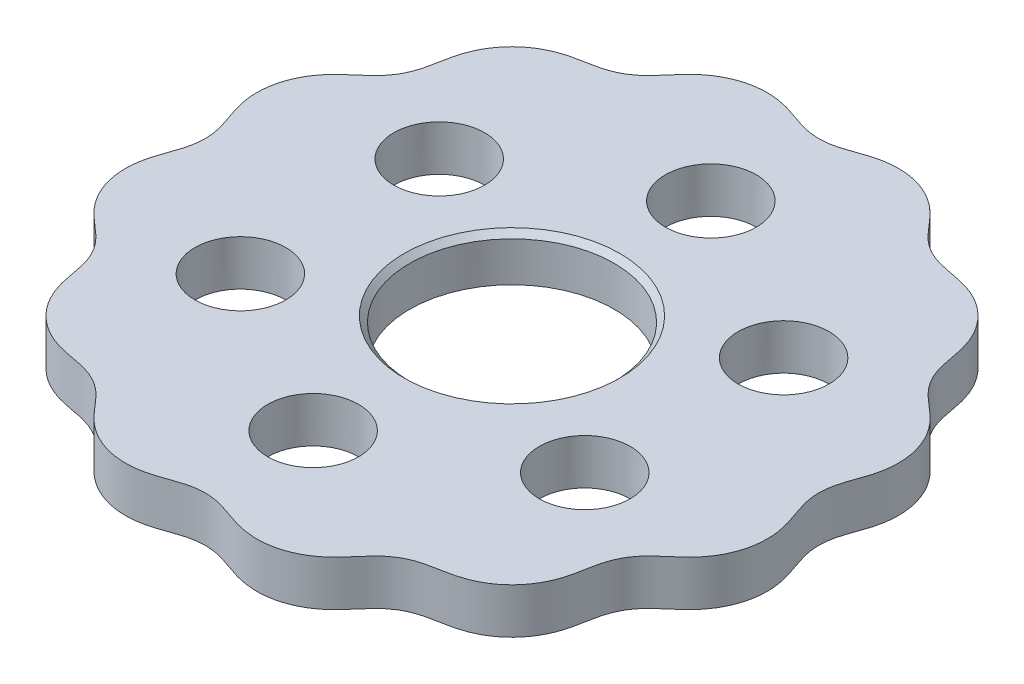
ISO-10303-21;
HEADER;
FILE_DESCRIPTION(('STEP AP214'),'2;1');
FILE_NAME('part.step','',(''),(''),'','','');
FILE_SCHEMA(('AUTOMOTIVE_DESIGN { 1 0 10303 214 1 1 1 1 }'));
ENDSEC;
DATA;
#1=APPLICATION_CONTEXT('core data for automotive mechanical design processes');
#2=APPLICATION_PROTOCOL_DEFINITION('international standard','automotive_design',2000,#1);
#3=PRODUCT_CONTEXT('',#1,'mechanical');
#4=PRODUCT('Part','Part','',(#3));
#5=PRODUCT_RELATED_PRODUCT_CATEGORY('part','',(#4));
#6=PRODUCT_DEFINITION_FORMATION('','',#4);
#7=PRODUCT_DEFINITION_CONTEXT('part definition',#1,'design');
#8=PRODUCT_DEFINITION('design','',#6,#7);
#9=PRODUCT_DEFINITION_SHAPE('','',#8);
#10=(LENGTH_UNIT() NAMED_UNIT(*) SI_UNIT(.MILLI.,.METRE.));
#11=(NAMED_UNIT(*) PLANE_ANGLE_UNIT() SI_UNIT($,.RADIAN.));
#12=(NAMED_UNIT(*) SI_UNIT($,.STERADIAN.) SOLID_ANGLE_UNIT());
#13=UNCERTAINTY_MEASURE_WITH_UNIT(LENGTH_MEASURE(1.E-05),#10,'distance_accuracy_value','');
#14=(GEOMETRIC_REPRESENTATION_CONTEXT(3) GLOBAL_UNCERTAINTY_ASSIGNED_CONTEXT((#13)) GLOBAL_UNIT_ASSIGNED_CONTEXT((#10,
#11,#12)) REPRESENTATION_CONTEXT('',''));
#15=CARTESIAN_POINT('',(0.,0.,0.));
#16=DIRECTION('',(0.,0.,1.));
#17=DIRECTION('',(1.,0.,0.));
#18=AXIS2_PLACEMENT_3D('',#15,#16,#17);
#19=CARTESIAN_POINT('',(27.,4.,9.22800886957361E-11));
#20=DIRECTION('',(-0.999999926527916,0.,-0.000383332964961151));
#21=DIRECTION('',(-0.000383332964961151,0.,0.999999926527916));
#22=AXIS2_PLACEMENT_3D('',#19,#20,#21);
#23=PLANE('',#22);
#24=CARTESIAN_POINT('',(27.,0.,9.22800886957361E-11));
#25=CARTESIAN_POINT('',(27.0000015716642,0.,-0.00409999716100518));
#26=B_SPLINE_CURVE_WITH_KNOTS('',1,(#24,#25),.UNSPECIFIED.,.F.,.F.,(2,2),(0.,1.),.UNSPECIFIED.);
#27=CARTESIAN_POINT('',(27.,0.,1.15350105787478E-10));
#28=VERTEX_POINT('',#27);
#29=CARTESIAN_POINT('',(27.0000015716642,0.,-0.0040999970740738));
#30=VERTEX_POINT('',#29);
#31=EDGE_CURVE('E87',#28,#30,#26,.T.);
#32=ORIENTED_EDGE('',*,*,#31,.T.);
#33=DIRECTION('',(0.,-1.,0.));
#34=VECTOR('',#33,1.);
#35=CARTESIAN_POINT('',(27.0000015716642,4.,-0.0040999970740738));
#36=LINE('',#35,#34);
#37=CARTESIAN_POINT('',(27.0000015716642,4.,-0.0040999970740738));
#38=VERTEX_POINT('',#37);
#39=EDGE_CURVE('E83',#38,#30,#36,.T.);
#40=ORIENTED_EDGE('',*,*,#39,.F.);
#41=CARTESIAN_POINT('',(27.,4.,9.22800886957361E-11));
#42=CARTESIAN_POINT('',(27.0000015716642,4.,-0.00409999716100518));
#43=B_SPLINE_CURVE_WITH_KNOTS('',1,(#41,#42),.UNSPECIFIED.,.F.,.F.,(2,2),(0.,1.),.UNSPECIFIED.);
#44=CARTESIAN_POINT('',(27.,4.,1.15350105787478E-10));
#45=VERTEX_POINT('',#44);
#46=EDGE_CURVE('E86',#45,#38,#43,.T.);
#47=ORIENTED_EDGE('',*,*,#46,.F.);
#48=DIRECTION('',(0.,-1.,0.));
#49=VECTOR('',#48,1.);
#50=CARTESIAN_POINT('',(27.,4.,1.15350105787478E-10));
#51=LINE('',#50,#49);
#52=EDGE_CURVE('E80',#45,#28,#51,.T.);
#53=ORIENTED_EDGE('',*,*,#52,.T.);
#54=EDGE_LOOP('',(#32,#40,#47,#53));
#55=FACE_BOUND('',#54,.T.);
#56=ADVANCED_FACE('F49',(#55),#23,.F.);
#57=CARTESIAN_POINT('',(27.0000015716642,4.,-0.0040999970740738));
#58=CARTESIAN_POINT('',(27.0000244484234,4.,-0.0339392810021794));
#59=CARTESIAN_POINT('',(27.0005304269458,4.,-0.07873320100623));
#60=CARTESIAN_POINT('',(27.002159238969,4.,-0.152753864287575));
#61=CARTESIAN_POINT('',(27.0079260189087,4.,-0.306185400184545));
#62=CARTESIAN_POINT('',(27.0198032377593,4.,-0.486134543892335));
#63=CARTESIAN_POINT('',(27.0442361711245,4.,-0.710209831575729));
#64=CARTESIAN_POINT('',(27.0884334298475,4.,-0.994680929823416));
#65=CARTESIAN_POINT('',(27.1457643024793,4.,-1.27114439302302));
#66=CARTESIAN_POINT('',(27.2321717977341,4.,-1.61674575590789));
#67=CARTESIAN_POINT('',(27.3560734123242,4.,-2.02396200951451));
#68=CARTESIAN_POINT('',(27.5210009056152,4.,-2.49350803824811));
#69=CARTESIAN_POINT('',(27.7162724516742,4.,-3.02678805022896));
#70=CARTESIAN_POINT('',(27.8972374228975,4.,-3.56570108518777));
#71=CARTESIAN_POINT('',(28.0642219258353,4.,-4.17060877528699));
#72=CARTESIAN_POINT('',(28.1930011060433,4.,-4.84554244802918));
#73=CARTESIAN_POINT('',(28.274636512001,4.,-5.79026897996571));
#74=CARTESIAN_POINT('',(28.1878772085396,4.,-6.99381965304455));
#75=CARTESIAN_POINT('',(27.8097902938465,4.,-8.35041784673789));
#76=CARTESIAN_POINT('',(27.0828678084063,4.,-9.64980286808452));
#77=CARTESIAN_POINT('',(26.1839296137999,4.,-10.6738779590738));
#78=CARTESIAN_POINT('',(25.2358125265582,4.,-11.4737802283782));
#79=CARTESIAN_POINT('',(24.370354005674,4.,-12.193123574296));
#80=CARTESIAN_POINT('',(23.6190605575602,4.,-13.0405595192683));
#81=CARTESIAN_POINT('',(23.0618295749504,4.,-14.027974654569));
#82=CARTESIAN_POINT('',(22.7225096076187,4.,-15.1079409428691));
#83=CARTESIAN_POINT('',(22.5401153959099,4.,-16.2179415220067));
#84=CARTESIAN_POINT('',(22.3106276044754,4.,-17.4374921197559));
#85=CARTESIAN_POINT('',(21.8545936867957,4.,-18.7217244182586));
#86=CARTESIAN_POINT('',(21.0767954527754,4.,-19.9840798535619));
#87=CARTESIAN_POINT('',(19.9418864008962,4.,-21.1099979467255));
#88=CARTESIAN_POINT('',(18.6734042785689,4.,-21.8777643942059));
#89=CARTESIAN_POINT('',(17.3858227799011,4.,-22.3240252437293));
#90=CARTESIAN_POINT('',(16.1654469621031,4.,-22.5476881375256));
#91=CARTESIAN_POINT('',(15.0558514955551,4.,-22.733997897836));
#92=CARTESIAN_POINT('',(13.9787577448736,4.,-23.0832138422773));
#93=CARTESIAN_POINT('',(12.9971431397588,4.,-23.6505932158244));
#94=CARTESIAN_POINT('',(12.1568472429252,4.,-24.409493008101));
#95=CARTESIAN_POINT('',(11.4410205779606,4.,-25.2775084306964));
#96=CARTESIAN_POINT('',(10.6367030906937,4.,-26.2222170973788));
#97=CARTESIAN_POINT('',(9.60578927405974,4.,-27.1134259413189));
#98=CARTESIAN_POINT('',(8.30610353361356,4.,-27.8270981610101));
#99=CARTESIAN_POINT('',(6.76325670490686,4.,-28.245828875078));
#100=CARTESIAN_POINT('',(5.28109437562332,4.,-28.2871231594632));
#101=CARTESIAN_POINT('',(3.94108532648328,4.,-28.0389745584077));
#102=CARTESIAN_POINT('',(2.77039275955104,4.,-27.627408479797));
#103=CARTESIAN_POINT('',(1.71776190423759,4.,-27.23068931312));
#104=CARTESIAN_POINT('',(0.612584807266868,4.,-26.985514684254));
#105=CARTESIAN_POINT('',(-0.521165890577715,4.,-26.9754952209441));
#106=CARTESIAN_POINT('',(-1.63049251996372,4.,-27.2033966215677));
#107=CARTESIAN_POINT('',(-2.68601217324515,4.,-27.5936229422302));
#108=CARTESIAN_POINT('',(-3.8530105532449,4.,-28.0143016070755));
#109=CARTESIAN_POINT('',(-5.18954444308002,4.,-28.2797825456004));
#110=CARTESIAN_POINT('',(-6.67836591286768,4.,-28.2585373638715));
#111=CARTESIAN_POINT('',(-8.23855985142709,4.,-27.8558107859252));
#112=CARTESIAN_POINT('',(-9.5592001005529,4.,-27.1475718954185));
#113=CARTESIAN_POINT('',(-10.6098942657333,4.,-26.250958295212));
#114=CARTESIAN_POINT('',(-11.4261266630729,4.,-25.2966701495425));
#115=CARTESIAN_POINT('',(-12.1475565882439,4.,-24.4184431986962));
#116=CARTESIAN_POINT('',(-12.9955308705807,4.,-23.6504733011948));
#117=CARTESIAN_POINT('',(-13.987888625458,4.,-23.0780544092839));
#118=CARTESIAN_POINT('',(-15.0771826127988,4.,-22.7284374440517));
#119=CARTESIAN_POINT('',(-16.198497390375,4.,-22.5430765422845));
#120=CARTESIAN_POINT('',(-17.4329889431198,4.,-22.3128862016379));
#121=CARTESIAN_POINT('',(-18.7345641510939,4.,-21.8505073756346));
#122=CARTESIAN_POINT('',(-20.0077601235838,4.,-21.0601479620353));
#123=CARTESIAN_POINT('',(-21.1359296453693,4.,-19.9096590050618));
#124=CARTESIAN_POINT('',(-21.8979671721226,4.,-18.6304633703646));
#125=CARTESIAN_POINT('',(-22.3355750875532,4.,-17.3400054274809));
#126=CARTESIAN_POINT('',(-22.554344619362,4.,-16.1189609672778));
#127=CARTESIAN_POINT('',(-22.7445040156435,4.,-15.0097784397211));
#128=CARTESIAN_POINT('',(-23.1025637929627,4.,-13.935358019104));
#129=CARTESIAN_POINT('',(-23.6788847882606,4.,-12.9589635684495));
#130=CARTESIAN_POINT('',(-24.4443617256028,4.,-12.1249831589227));
#131=CARTESIAN_POINT('',(-25.3144126941894,4.,-11.4119685054146));
#132=CARTESIAN_POINT('',(-26.2559014222923,4.,-10.6035408797703));
#133=CARTESIAN_POINT('',(-27.1402118481749,4.,-9.56661708953337));
#134=CARTESIAN_POINT('',(-27.8447418263077,4.,-8.26195281544402));
#135=CARTESIAN_POINT('',(-28.2525956334913,4.,-6.71619555673127));
#136=CARTESIAN_POINT('',(-28.2834838471351,4.,-5.23377926545721));
#137=CARTESIAN_POINT('',(-28.0263593102599,4.,-3.89553187590193));
#138=CARTESIAN_POINT('',(-27.6099703395077,4.,-2.72678284921799));
#139=CARTESIAN_POINT('',(-27.2164490273536,4.,-1.67272243958398));
#140=CARTESIAN_POINT('',(-26.9801395952342,4.,-0.565370051796549));
#141=CARTESIAN_POINT('',(-26.9804741873882,4.,0.5684228967716));
#142=CARTESIAN_POINT('',(-27.2173605456043,4.,1.67563666063786));
#143=CARTESIAN_POINT('',(-27.6110986637257,4.,2.72960050748098));
#144=CARTESIAN_POINT('',(-28.0271832981977,4.,3.89847299684735));
#145=CARTESIAN_POINT('',(-28.2837289031908,4.,5.23683637524653));
#146=CARTESIAN_POINT('',(-28.2521684066599,4.,6.71923822744481));
#147=CARTESIAN_POINT('',(-27.8436109551201,4.,8.26481003135531));
#148=CARTESIAN_POINT('',(-27.1384889851912,4.,9.56915416604704));
#149=CARTESIAN_POINT('',(-26.2537306947376,4.,10.6056908261978));
#150=CARTESIAN_POINT('',(-25.3120286722542,4.,11.4138474593151));
#151=CARTESIAN_POINT('',(-24.4421025478062,4.,12.1270350268679));
#152=CARTESIAN_POINT('',(-23.6770462052661,4.,12.9614232130097));
#153=CARTESIAN_POINT('',(-23.1013015770716,4.,13.9381572582798));
#154=CARTESIAN_POINT('',(-22.7438154949222,4.,15.0127542561048));
#155=CARTESIAN_POINT('',(-22.553915448645,4.,16.1219649218201));
#156=CARTESIAN_POINT('',(-22.3348376661072,4.,17.3429682603798));
#157=CARTESIAN_POINT('',(-21.8966704072072,4.,18.6332423824535));
#158=CARTESIAN_POINT('',(-21.1340538070914,4.,19.9120923021861));
#159=CARTESIAN_POINT('',(-20.0053600695423,4.,21.0620678102741));
#160=CARTESIAN_POINT('',(-18.7318062880613,4.,21.8518491030051));
#161=CARTESIAN_POINT('',(-17.4300345016617,4.,22.3136595922247));
#162=CARTESIAN_POINT('',(-16.1954960902811,4.,22.5435074477447));
#163=CARTESIAN_POINT('',(-15.0742060049806,4.,22.7290947932359));
#164=CARTESIAN_POINT('',(-13.9850809861389,4.,23.0792857186833));
#165=CARTESIAN_POINT('',(-12.9930603566187,4.,23.6522886562751));
#166=CARTESIAN_POINT('',(-12.1454986628799,4.,24.4206920699987));
#167=CARTESIAN_POINT('',(-11.4242529037972,4.,25.2990539408724));
#168=CARTESIAN_POINT('',(-10.6077475831555,4.,26.2531305077497));
#169=CARTESIAN_POINT('',(-9.5566594484237,4.,27.1492897931313));
#170=CARTESIAN_POINT('',(-8.23569735979198,4.,27.8569298047064));
#171=CARTESIAN_POINT('',(-6.67532074434484,4.,28.2589457050631));
#172=CARTESIAN_POINT('',(-5.18648932135376,4.,28.2795165230908));
#173=CARTESIAN_POINT('',(-3.85007580986316,4.,28.0134592087028));
#174=CARTESIAN_POINT('',(-2.68319605558515,4.,27.5924926678098));
#175=CARTESIAN_POINT('',(-1.6275712721048,4.,27.2025045616811));
#176=CARTESIAN_POINT('',(-0.518110613107215,4.,26.9751881182735));
#177=CARTESIAN_POINT('',(0.615634296059388,4.,26.9858765368276));
#178=CARTESIAN_POINT('',(1.72066862932771,4.,27.2316194918736));
#179=CARTESIAN_POINT('',(2.77321195882614,4.,27.6285337053039));
#180=CARTESIAN_POINT('',(3.94403247352572,4.,28.0397798951112));
#181=CARTESIAN_POINT('',(5.28415295259804,4.,28.2873471194994));
#182=CARTESIAN_POINT('',(6.76629662538961,4.,28.2453800939004));
#183=CARTESIAN_POINT('',(8.30895236179318,4.,27.8259472452917));
#184=CARTESIAN_POINT('',(9.60831453857364,4.,27.1116855367421));
#185=CARTESIAN_POINT('',(10.6388384981508,4.,26.2200332205968));
#186=CARTESIAN_POINT('',(11.442896635263,4.,25.275122475502));
#187=CARTESIAN_POINT('',(12.1589149325799,4.,24.4072462219114));
#188=CARTESIAN_POINT('',(12.9996193356664,4.,23.6487765490219));
#189=CARTESIAN_POINT('',(13.981568641392,4.,23.0819766425324));
#190=CARTESIAN_POINT('',(15.0588309737662,4.,22.7333297521329));
#191=CARTESIAN_POINT('',(16.1684512868352,4.,22.5472565277042));
#192=CARTESIAN_POINT('',(17.388781941976,4.,22.3232686931859));
#193=CARTESIAN_POINT('',(18.6761745371901,4.,21.8764484710044));
#194=CARTESIAN_POINT('',(19.9443080976805,4.,21.1081070033712));
#195=CARTESIAN_POINT('',(21.0787048087525,4.,19.981672159725));
#196=CARTESIAN_POINT('',(21.8559298352824,4.,18.7189640561845));
#197=CARTESIAN_POINT('',(22.3114045627037,4.,17.434537310411));
#198=CARTESIAN_POINT('',(22.54055069075,4.,16.2149374793626));
#199=CARTESIAN_POINT('',(22.7231565682339,4.,15.1049583669503));
#200=CARTESIAN_POINT('',(23.0630398461702,4.,14.0251524797909));
#201=CARTESIAN_POINT('',(23.620853175058,4.,13.0380662505843));
#202=CARTESIAN_POINT('',(24.372586568022,4.,12.191039395322));
#203=CARTESIAN_POINT('',(25.2381994727871,4.,11.4719059830387));
#204=CARTESIAN_POINT('',(26.1861270240563,4.,10.6717593207468));
#205=CARTESIAN_POINT('',(27.0846265424607,4.,9.64728898081318));
#206=CARTESIAN_POINT('',(27.8109872594051,4.,8.34753084721824));
#207=CARTESIAN_POINT('',(28.1884648125664,4.,6.99066698671307));
#208=CARTESIAN_POINT('',(28.2746521603342,4.,5.78697201722075));
#209=CARTESIAN_POINT('',(28.1925409617039,4.,4.84214050716381));
#210=CARTESIAN_POINT('',(28.0634270975877,4.,4.16720549021462));
#211=CARTESIAN_POINT('',(27.8961727407687,4.,3.56221827237287));
#212=CARTESIAN_POINT('',(27.7376816721069,4.,3.09077122652693));
#213=CARTESIAN_POINT('',(27.5929532296721,4.,2.6899152608719));
#214=CARTESIAN_POINT('',(27.4730469550011,4.,2.35559602405298));
#215=CARTESIAN_POINT('',(27.3801659464178,4.,2.08706705700083));
#216=CARTESIAN_POINT('',(27.2929902083367,4.,1.81659402118249));
#217=CARTESIAN_POINT('',(27.2138720005242,4.,1.54365220853864));
#218=CARTESIAN_POINT('',(27.1535107135987,4.,1.3023827818137));
#219=CARTESIAN_POINT('',(27.109159090362,4.,1.09391474556526));
#220=CARTESIAN_POINT('',(27.0775424292434,4.,0.919236466055205));
#221=CARTESIAN_POINT('',(27.0555988918368,4.,0.77865794264015));
#222=CARTESIAN_POINT('',(27.037127869559,4.,0.637409177069768));
#223=CARTESIAN_POINT('',(27.0222307277008,4.,0.497376741371319));
#224=CARTESIAN_POINT('',(27.0123933115686,4.,0.375375190333219));
#225=CARTESIAN_POINT('',(27.0062827399974,4.,0.263641882547648));
#226=CARTESIAN_POINT('',(27.0020443120296,4.,0.148526867702279));
#227=CARTESIAN_POINT('',(27.000471764553,4.,0.074622860545435));
#228=CARTESIAN_POINT('',(27.0000000000009,4.,0.0298433657233376));
#229=CARTESIAN_POINT('',(27.,4.,1.15350105787478E-10));
#230=B_SPLINE_CURVE_WITH_KNOTS('',4,(#57,#58,#59,#60,#61,#62,#63,#64,#65,#66,#67,#68,#69,#70,
#71,#72,#73,#74,#75,#76,#77,#78,#79,#80,#81,#82,#83,#84,#85,#86,#87,#88,#89,#90,#91,#92,#93,#94,
#95,#96,#97,#98,#99,#100,#101,#102,#103,#104,#105,#106,#107,#108,#109,#110,#111,#112,#113,#114,
#115,#116,#117,#118,#119,#120,#121,#122,#123,#124,#125,#126,#127,#128,#129,#130,#131,#132,#133,
#134,#135,#136,#137,#138,#139,#140,#141,#142,#143,#144,#145,#146,#147,#148,#149,#150,#151,#152,
#153,#154,#155,#156,#157,#158,#159,#160,#161,#162,#163,#164,#165,#166,#167,#168,#169,#170,#171,
#172,#173,#174,#175,#176,#177,#178,#179,#180,#181,#182,#183,#184,#185,#186,#187,#188,#189,#190,
#191,#192,#193,#194,#195,#196,#197,#198,#199,#200,#201,#202,#203,#204,#205,#206,#207,#208,#209,
#210,#211,#212,#213,#214,#215,#216,#217,#218,#219,#220,#221,#222,#223,#224,#225,#226,#227,#228,
#229),.UNSPECIFIED.,.F.,.F.,(5,1,1,1,1,1,1,1,1,1,1,1,1,1,1,1,1,1,1,1,1,1,1,1,1,1,1,1,1,1,1,1,1,
1,1,1,1,1,1,1,1,1,1,1,1,1,1,1,1,1,1,1,1,1,1,1,1,1,1,1,1,1,1,1,1,1,1,1,1,1,1,1,1,1,1,1,1,1,1,1,1,
1,1,1,1,1,1,1,1,1,1,1,1,1,1,1,1,1,1,1,1,1,1,1,1,1,1,1,1,1,1,1,1,1,1,1,1,1,1,1,1,1,1,1,1,1,1,1,1,
1,1,1,1,1,1,1,1,1,1,1,1,1,1,1,1,1,1,1,1,1,1,1,1,1,1,1,1,1,1,1,1,1,1,1,1,1,1,1,1,5),
(0.0798644491082758,0.0805110743862684,0.0808343870252647,0.081157699664261,0.0824509502202461,
0.0837442007762311,0.0850374513322162,0.0863307018882012,0.0876239524441863,0.0902104535561565,
0.0927969546681267,0.0953834557800969,0.097969956892067,0.100556458004037,0.104216614236069,
0.107876770468101,0.115197082932164,0.122406217836767,0.12961535274137,0.134736600459656,
0.139857848177942,0.144979095896228,0.150100343614515,0.155221409188006,0.160342474761498,
0.16546354033499,0.170584605908481,0.177793672105988,0.185002738303495,0.192211845114803,
0.199420951926112,0.20454210994399,0.209663267961869,0.214784425979748,0.219905583997626,
0.225026732689409,0.230147881381192,0.235269030072975,0.240390178764758,0.24759928212308,
0.254808385481402,0.262017455963055,0.269226526444708,0.274347600162707,0.279468673880706,
0.284589747598706,0.289710821316705,0.294832059635587,0.299953297954469,0.305074536273351,
0.310195774592233,0.317404906940895,0.324614039289556,0.331935362417552,0.339256685545547,
0.344430391650072,0.349604097754597,0.354777803859121,0.359951509963646,0.365125220533907,
0.370298931104167,0.375472641674427,0.380646352244688,0.38796767223086,0.395288992217032,
0.402498126618267,0.409707261019501,0.41482850686206,0.419949752704619,0.425070998547177,
0.430192244389736,0.435313311577422,0.440434378765107,0.445555445952793,0.450676513140478,
0.457885580201512,0.465094647262546,0.472303753390568,0.47951285951859,0.484634015666048,
0.489755171813506,0.494876327960964,0.499997484108422,0.505118634660025,0.510239785211628,
0.515360935763231,0.520482086314835,0.527691190371051,0.534900294427268,0.542109364058805,
0.549318433690342,0.554439505764926,0.559560577839511,0.564681649914095,0.56980272198868,
0.5749239621914,0.58004520239412,0.58516644259684,0.59028768279956,0.597496815667218,
0.604705948534877,0.612027270887487,0.619348593240097,0.6245223004472,0.629696007654304,
0.634869714861407,0.640043422068511,0.645217131534123,0.650390840999735,0.655564550465347,
0.66073825993096,0.668059580712651,0.675380901494343,0.682590035388293,0.689799169282243,
0.6949204132469,0.700041657211558,0.705162901176215,0.710284145140872,0.715405213950202,
0.720526282759533,0.725647351568864,0.730768420378195,0.737977488299415,0.745186556220635,
0.752395661661707,0.75960476710278,0.76472592138232,0.76984707566186,0.7749682299414,
0.78008938422094,0.785210536635162,0.790331689049384,0.795452841463606,0.800573993877827,
0.807783098628297,0.814992203378766,0.822201272156822,0.829410340934878,0.834531411373208,
0.839652481811537,0.844773552249867,0.849894622688196,0.855015864772874,0.860137106857552,
0.86525834894223,0.870379591026908,0.877588724409665,0.884797857792421,0.892119179362928,
0.895779840148182,0.899440500933435,0.902027355101441,0.904614209269448,0.907201063437454,
0.908494490521457,0.909787917605461,0.911081344689464,0.912374771773467,0.91366819885747,
0.914961625941473,0.915608339483475,0.916255053025477,0.916901766567478,0.91754848010948,
0.918195193651481,0.918841907193483,0.919165263964484,0.919488620735485,0.920135334277486),.UNSPECIFIED.);
#231=DIRECTION('',(0.,-1.,0.));
#232=VECTOR('',#231,1.);
#233=SURFACE_OF_LINEAR_EXTRUSION('',#230,#232);
#234=CARTESIAN_POINT('',(27.0000015716642,0.,-0.0040999970740738));
#235=CARTESIAN_POINT('',(27.0000244484234,0.,-0.0339392810021794));
#236=CARTESIAN_POINT('',(27.0005304269458,0.,-0.07873320100623));
#237=CARTESIAN_POINT('',(27.002159238969,0.,-0.152753864287575));
#238=CARTESIAN_POINT('',(27.0079260189087,0.,-0.306185400184545));
#239=CARTESIAN_POINT('',(27.0198032377593,0.,-0.486134543892335));
#240=CARTESIAN_POINT('',(27.0442361711245,0.,-0.710209831575729));
#241=CARTESIAN_POINT('',(27.0884334298475,0.,-0.994680929823416));
#242=CARTESIAN_POINT('',(27.1457643024793,0.,-1.27114439302302));
#243=CARTESIAN_POINT('',(27.2321717977341,0.,-1.61674575590789));
#244=CARTESIAN_POINT('',(27.3560734123242,0.,-2.02396200951451));
#245=CARTESIAN_POINT('',(27.5210009056152,0.,-2.49350803824811));
#246=CARTESIAN_POINT('',(27.7162724516742,0.,-3.02678805022896));
#247=CARTESIAN_POINT('',(27.8972374228975,0.,-3.56570108518777));
#248=CARTESIAN_POINT('',(28.0642219258353,0.,-4.17060877528699));
#249=CARTESIAN_POINT('',(28.1930011060433,0.,-4.84554244802918));
#250=CARTESIAN_POINT('',(28.274636512001,0.,-5.79026897996571));
#251=CARTESIAN_POINT('',(28.1878772085396,0.,-6.99381965304455));
#252=CARTESIAN_POINT('',(27.8097902938465,0.,-8.35041784673789));
#253=CARTESIAN_POINT('',(27.0828678084063,0.,-9.64980286808452));
#254=CARTESIAN_POINT('',(26.1839296137999,0.,-10.6738779590738));
#255=CARTESIAN_POINT('',(25.2358125265582,0.,-11.4737802283782));
#256=CARTESIAN_POINT('',(24.370354005674,0.,-12.193123574296));
#257=CARTESIAN_POINT('',(23.6190605575602,0.,-13.0405595192683));
#258=CARTESIAN_POINT('',(23.0618295749504,0.,-14.027974654569));
#259=CARTESIAN_POINT('',(22.7225096076187,0.,-15.1079409428691));
#260=CARTESIAN_POINT('',(22.5401153959099,0.,-16.2179415220067));
#261=CARTESIAN_POINT('',(22.3106276044754,0.,-17.4374921197559));
#262=CARTESIAN_POINT('',(21.8545936867957,0.,-18.7217244182586));
#263=CARTESIAN_POINT('',(21.0767954527754,0.,-19.9840798535619));
#264=CARTESIAN_POINT('',(19.9418864008962,0.,-21.1099979467255));
#265=CARTESIAN_POINT('',(18.6734042785689,0.,-21.8777643942059));
#266=CARTESIAN_POINT('',(17.3858227799011,0.,-22.3240252437293));
#267=CARTESIAN_POINT('',(16.1654469621031,0.,-22.5476881375256));
#268=CARTESIAN_POINT('',(15.0558514955551,0.,-22.733997897836));
#269=CARTESIAN_POINT('',(13.9787577448736,0.,-23.0832138422773));
#270=CARTESIAN_POINT('',(12.9971431397588,0.,-23.6505932158244));
#271=CARTESIAN_POINT('',(12.1568472429252,0.,-24.409493008101));
#272=CARTESIAN_POINT('',(11.4410205779606,0.,-25.2775084306964));
#273=CARTESIAN_POINT('',(10.6367030906937,0.,-26.2222170973788));
#274=CARTESIAN_POINT('',(9.60578927405974,0.,-27.1134259413189));
#275=CARTESIAN_POINT('',(8.30610353361356,0.,-27.8270981610101));
#276=CARTESIAN_POINT('',(6.76325670490686,0.,-28.245828875078));
#277=CARTESIAN_POINT('',(5.28109437562332,0.,-28.2871231594632));
#278=CARTESIAN_POINT('',(3.94108532648328,0.,-28.0389745584077));
#279=CARTESIAN_POINT('',(2.77039275955104,0.,-27.627408479797));
#280=CARTESIAN_POINT('',(1.71776190423759,0.,-27.23068931312));
#281=CARTESIAN_POINT('',(0.612584807266868,0.,-26.985514684254));
#282=CARTESIAN_POINT('',(-0.521165890577715,0.,-26.9754952209441));
#283=CARTESIAN_POINT('',(-1.63049251996372,0.,-27.2033966215677));
#284=CARTESIAN_POINT('',(-2.68601217324515,0.,-27.5936229422302));
#285=CARTESIAN_POINT('',(-3.8530105532449,0.,-28.0143016070755));
#286=CARTESIAN_POINT('',(-5.18954444308002,0.,-28.2797825456004));
#287=CARTESIAN_POINT('',(-6.67836591286768,0.,-28.2585373638715));
#288=CARTESIAN_POINT('',(-8.23855985142709,0.,-27.8558107859252));
#289=CARTESIAN_POINT('',(-9.5592001005529,0.,-27.1475718954185));
#290=CARTESIAN_POINT('',(-10.6098942657333,0.,-26.250958295212));
#291=CARTESIAN_POINT('',(-11.4261266630729,0.,-25.2966701495425));
#292=CARTESIAN_POINT('',(-12.1475565882439,0.,-24.4184431986962));
#293=CARTESIAN_POINT('',(-12.9955308705807,0.,-23.6504733011948));
#294=CARTESIAN_POINT('',(-13.987888625458,0.,-23.0780544092839));
#295=CARTESIAN_POINT('',(-15.0771826127988,0.,-22.7284374440517));
#296=CARTESIAN_POINT('',(-16.198497390375,0.,-22.5430765422845));
#297=CARTESIAN_POINT('',(-17.4329889431198,0.,-22.3128862016379));
#298=CARTESIAN_POINT('',(-18.7345641510939,0.,-21.8505073756346));
#299=CARTESIAN_POINT('',(-20.0077601235838,0.,-21.0601479620353));
#300=CARTESIAN_POINT('',(-21.1359296453693,0.,-19.9096590050618));
#301=CARTESIAN_POINT('',(-21.8979671721226,0.,-18.6304633703646));
#302=CARTESIAN_POINT('',(-22.3355750875532,0.,-17.3400054274809));
#303=CARTESIAN_POINT('',(-22.554344619362,0.,-16.1189609672778));
#304=CARTESIAN_POINT('',(-22.7445040156435,0.,-15.0097784397211));
#305=CARTESIAN_POINT('',(-23.1025637929627,0.,-13.935358019104));
#306=CARTESIAN_POINT('',(-23.6788847882606,0.,-12.9589635684495));
#307=CARTESIAN_POINT('',(-24.4443617256028,0.,-12.1249831589227));
#308=CARTESIAN_POINT('',(-25.3144126941894,0.,-11.4119685054146));
#309=CARTESIAN_POINT('',(-26.2559014222923,0.,-10.6035408797703));
#310=CARTESIAN_POINT('',(-27.1402118481749,0.,-9.56661708953337));
#311=CARTESIAN_POINT('',(-27.8447418263077,0.,-8.26195281544402));
#312=CARTESIAN_POINT('',(-28.2525956334913,0.,-6.71619555673127));
#313=CARTESIAN_POINT('',(-28.2834838471351,0.,-5.23377926545721));
#314=CARTESIAN_POINT('',(-28.0263593102599,0.,-3.89553187590193));
#315=CARTESIAN_POINT('',(-27.6099703395077,0.,-2.72678284921799));
#316=CARTESIAN_POINT('',(-27.2164490273536,0.,-1.67272243958398));
#317=CARTESIAN_POINT('',(-26.9801395952342,0.,-0.565370051796549));
#318=CARTESIAN_POINT('',(-26.9804741873882,0.,0.5684228967716));
#319=CARTESIAN_POINT('',(-27.2173605456043,0.,1.67563666063786));
#320=CARTESIAN_POINT('',(-27.6110986637257,0.,2.72960050748098));
#321=CARTESIAN_POINT('',(-28.0271832981977,0.,3.89847299684735));
#322=CARTESIAN_POINT('',(-28.2837289031908,0.,5.23683637524653));
#323=CARTESIAN_POINT('',(-28.2521684066599,0.,6.71923822744481));
#324=CARTESIAN_POINT('',(-27.8436109551201,0.,8.26481003135531));
#325=CARTESIAN_POINT('',(-27.1384889851912,0.,9.56915416604704));
#326=CARTESIAN_POINT('',(-26.2537306947376,0.,10.6056908261978));
#327=CARTESIAN_POINT('',(-25.3120286722542,0.,11.4138474593151));
#328=CARTESIAN_POINT('',(-24.4421025478062,0.,12.1270350268679));
#329=CARTESIAN_POINT('',(-23.6770462052661,0.,12.9614232130097));
#330=CARTESIAN_POINT('',(-23.1013015770716,0.,13.9381572582798));
#331=CARTESIAN_POINT('',(-22.7438154949222,0.,15.0127542561048));
#332=CARTESIAN_POINT('',(-22.553915448645,0.,16.1219649218201));
#333=CARTESIAN_POINT('',(-22.3348376661072,0.,17.3429682603798));
#334=CARTESIAN_POINT('',(-21.8966704072072,0.,18.6332423824535));
#335=CARTESIAN_POINT('',(-21.1340538070914,0.,19.9120923021861));
#336=CARTESIAN_POINT('',(-20.0053600695423,0.,21.0620678102741));
#337=CARTESIAN_POINT('',(-18.7318062880613,0.,21.8518491030051));
#338=CARTESIAN_POINT('',(-17.4300345016617,0.,22.3136595922247));
#339=CARTESIAN_POINT('',(-16.1954960902811,0.,22.5435074477447));
#340=CARTESIAN_POINT('',(-15.0742060049806,0.,22.7290947932359));
#341=CARTESIAN_POINT('',(-13.9850809861389,0.,23.0792857186833));
#342=CARTESIAN_POINT('',(-12.9930603566187,0.,23.6522886562751));
#343=CARTESIAN_POINT('',(-12.1454986628799,0.,24.4206920699987));
#344=CARTESIAN_POINT('',(-11.4242529037972,0.,25.2990539408724));
#345=CARTESIAN_POINT('',(-10.6077475831555,0.,26.2531305077497));
#346=CARTESIAN_POINT('',(-9.5566594484237,0.,27.1492897931313));
#347=CARTESIAN_POINT('',(-8.23569735979198,0.,27.8569298047064));
#348=CARTESIAN_POINT('',(-6.67532074434484,0.,28.2589457050631));
#349=CARTESIAN_POINT('',(-5.18648932135376,0.,28.2795165230908));
#350=CARTESIAN_POINT('',(-3.85007580986316,0.,28.0134592087028));
#351=CARTESIAN_POINT('',(-2.68319605558515,0.,27.5924926678098));
#352=CARTESIAN_POINT('',(-1.6275712721048,0.,27.2025045616811));
#353=CARTESIAN_POINT('',(-0.518110613107215,0.,26.9751881182735));
#354=CARTESIAN_POINT('',(0.615634296059388,0.,26.9858765368276));
#355=CARTESIAN_POINT('',(1.72066862932771,0.,27.2316194918736));
#356=CARTESIAN_POINT('',(2.77321195882614,0.,27.6285337053039));
#357=CARTESIAN_POINT('',(3.94403247352572,0.,28.0397798951112));
#358=CARTESIAN_POINT('',(5.28415295259804,0.,28.2873471194994));
#359=CARTESIAN_POINT('',(6.76629662538961,0.,28.2453800939004));
#360=CARTESIAN_POINT('',(8.30895236179318,0.,27.8259472452917));
#361=CARTESIAN_POINT('',(9.60831453857364,0.,27.1116855367421));
#362=CARTESIAN_POINT('',(10.6388384981508,0.,26.2200332205968));
#363=CARTESIAN_POINT('',(11.442896635263,0.,25.275122475502));
#364=CARTESIAN_POINT('',(12.1589149325799,0.,24.4072462219114));
#365=CARTESIAN_POINT('',(12.9996193356664,0.,23.6487765490219));
#366=CARTESIAN_POINT('',(13.981568641392,0.,23.0819766425324));
#367=CARTESIAN_POINT('',(15.0588309737662,0.,22.7333297521329));
#368=CARTESIAN_POINT('',(16.1684512868352,0.,22.5472565277042));
#369=CARTESIAN_POINT('',(17.388781941976,0.,22.3232686931859));
#370=CARTESIAN_POINT('',(18.6761745371901,0.,21.8764484710044));
#371=CARTESIAN_POINT('',(19.9443080976805,0.,21.1081070033712));
#372=CARTESIAN_POINT('',(21.0787048087525,0.,19.981672159725));
#373=CARTESIAN_POINT('',(21.8559298352824,0.,18.7189640561845));
#374=CARTESIAN_POINT('',(22.3114045627037,0.,17.434537310411));
#375=CARTESIAN_POINT('',(22.54055069075,0.,16.2149374793626));
#376=CARTESIAN_POINT('',(22.7231565682339,0.,15.1049583669503));
#377=CARTESIAN_POINT('',(23.0630398461702,0.,14.0251524797909));
#378=CARTESIAN_POINT('',(23.620853175058,0.,13.0380662505843));
#379=CARTESIAN_POINT('',(24.372586568022,0.,12.191039395322));
#380=CARTESIAN_POINT('',(25.2381994727871,0.,11.4719059830387));
#381=CARTESIAN_POINT('',(26.1861270240563,0.,10.6717593207468));
#382=CARTESIAN_POINT('',(27.0846265424607,0.,9.64728898081318));
#383=CARTESIAN_POINT('',(27.8109872594051,0.,8.34753084721824));
#384=CARTESIAN_POINT('',(28.1884648125664,0.,6.99066698671307));
#385=CARTESIAN_POINT('',(28.2746521603342,0.,5.78697201722075));
#386=CARTESIAN_POINT('',(28.1925409617039,0.,4.84214050716381));
#387=CARTESIAN_POINT('',(28.0634270975877,0.,4.16720549021462));
#388=CARTESIAN_POINT('',(27.8961727407687,0.,3.56221827237287));
#389=CARTESIAN_POINT('',(27.7376816721069,0.,3.09077122652693));
#390=CARTESIAN_POINT('',(27.5929532296721,0.,2.6899152608719));
#391=CARTESIAN_POINT('',(27.4730469550011,0.,2.35559602405298));
#392=CARTESIAN_POINT('',(27.3801659464178,0.,2.08706705700083));
#393=CARTESIAN_POINT('',(27.2929902083367,0.,1.81659402118249));
#394=CARTESIAN_POINT('',(27.2138720005242,0.,1.54365220853864));
#395=CARTESIAN_POINT('',(27.1535107135987,0.,1.3023827818137));
#396=CARTESIAN_POINT('',(27.109159090362,0.,1.09391474556526));
#397=CARTESIAN_POINT('',(27.0775424292434,0.,0.919236466055205));
#398=CARTESIAN_POINT('',(27.0555988918368,0.,0.77865794264015));
#399=CARTESIAN_POINT('',(27.037127869559,0.,0.637409177069768));
#400=CARTESIAN_POINT('',(27.0222307277008,0.,0.497376741371319));
#401=CARTESIAN_POINT('',(27.0123933115686,0.,0.375375190333219));
#402=CARTESIAN_POINT('',(27.0062827399974,0.,0.263641882547648));
#403=CARTESIAN_POINT('',(27.0020443120296,0.,0.148526867702279));
#404=CARTESIAN_POINT('',(27.000471764553,0.,0.074622860545435));
#405=CARTESIAN_POINT('',(27.0000000000009,0.,0.0298433657233376));
#406=CARTESIAN_POINT('',(27.,0.,1.15350105787478E-10));
#407=B_SPLINE_CURVE_WITH_KNOTS('',4,(#234,#235,#236,#237,#238,#239,#240,#241,#242,#243,#244,
#245,#246,#247,#248,#249,#250,#251,#252,#253,#254,#255,#256,#257,#258,#259,#260,#261,#262,#263,
#264,#265,#266,#267,#268,#269,#270,#271,#272,#273,#274,#275,#276,#277,#278,#279,#280,#281,#282,
#283,#284,#285,#286,#287,#288,#289,#290,#291,#292,#293,#294,#295,#296,#297,#298,#299,#300,#301,
#302,#303,#304,#305,#306,#307,#308,#309,#310,#311,#312,#313,#314,#315,#316,#317,#318,#319,#320,
#321,#322,#323,#324,#325,#326,#327,#328,#329,#330,#331,#332,#333,#334,#335,#336,#337,#338,#339,
#340,#341,#342,#343,#344,#345,#346,#347,#348,#349,#350,#351,#352,#353,#354,#355,#356,#357,#358,
#359,#360,#361,#362,#363,#364,#365,#366,#367,#368,#369,#370,#371,#372,#373,#374,#375,#376,#377,
#378,#379,#380,#381,#382,#383,#384,#385,#386,#387,#388,#389,#390,#391,#392,#393,#394,#395,#396,
#397,#398,#399,#400,#401,#402,#403,#404,#405,#406),.UNSPECIFIED.,.F.,.F.,(5,1,1,1,1,1,1,1,1,1,1,
1,1,1,1,1,1,1,1,1,1,1,1,1,1,1,1,1,1,1,1,1,1,1,1,1,1,1,1,1,1,1,1,1,1,1,1,1,1,1,1,1,1,1,1,1,1,1,1,
1,1,1,1,1,1,1,1,1,1,1,1,1,1,1,1,1,1,1,1,1,1,1,1,1,1,1,1,1,1,1,1,1,1,1,1,1,1,1,1,1,1,1,1,1,1,1,1,
1,1,1,1,1,1,1,1,1,1,1,1,1,1,1,1,1,1,1,1,1,1,1,1,1,1,1,1,1,1,1,1,1,1,1,1,1,1,1,1,1,1,1,1,1,1,1,1,
1,1,1,1,1,1,1,1,1,1,1,1,1,1,5),(0.0798644491082758,0.0805110743862684,0.0808343870252647,
0.081157699664261,0.0824509502202461,0.0837442007762311,0.0850374513322162,0.0863307018882012,
0.0876239524441863,0.0902104535561565,0.0927969546681267,0.0953834557800969,0.097969956892067,
0.100556458004037,0.104216614236069,0.107876770468101,0.115197082932164,0.122406217836767,
0.12961535274137,0.134736600459656,0.139857848177942,0.144979095896228,0.150100343614515,
0.155221409188006,0.160342474761498,0.16546354033499,0.170584605908481,0.177793672105988,
0.185002738303495,0.192211845114803,0.199420951926112,0.20454210994399,0.209663267961869,
0.214784425979748,0.219905583997626,0.225026732689409,0.230147881381192,0.235269030072975,
0.240390178764758,0.24759928212308,0.254808385481402,0.262017455963055,0.269226526444708,
0.274347600162707,0.279468673880706,0.284589747598706,0.289710821316705,0.294832059635587,
0.299953297954469,0.305074536273351,0.310195774592233,0.317404906940895,0.324614039289556,
0.331935362417552,0.339256685545547,0.344430391650072,0.349604097754597,0.354777803859121,
0.359951509963646,0.365125220533907,0.370298931104167,0.375472641674427,0.380646352244688,
0.38796767223086,0.395288992217032,0.402498126618267,0.409707261019501,0.41482850686206,
0.419949752704619,0.425070998547177,0.430192244389736,0.435313311577422,0.440434378765107,
0.445555445952793,0.450676513140478,0.457885580201512,0.465094647262546,0.472303753390568,
0.47951285951859,0.484634015666048,0.489755171813506,0.494876327960964,0.499997484108422,
0.505118634660025,0.510239785211628,0.515360935763231,0.520482086314835,0.527691190371051,
0.534900294427268,0.542109364058805,0.549318433690342,0.554439505764926,0.559560577839511,
0.564681649914095,0.56980272198868,0.5749239621914,0.58004520239412,0.58516644259684,
0.59028768279956,0.597496815667218,0.604705948534877,0.612027270887487,0.619348593240097,
0.6245223004472,0.629696007654304,0.634869714861407,0.640043422068511,0.645217131534123,
0.650390840999735,0.655564550465347,0.66073825993096,0.668059580712651,0.675380901494343,
0.682590035388293,0.689799169282243,0.6949204132469,0.700041657211558,0.705162901176215,
0.710284145140872,0.715405213950202,0.720526282759533,0.725647351568864,0.730768420378195,
0.737977488299415,0.745186556220635,0.752395661661707,0.75960476710278,0.76472592138232,
0.76984707566186,0.7749682299414,0.78008938422094,0.785210536635162,0.790331689049384,
0.795452841463606,0.800573993877827,0.807783098628297,0.814992203378766,0.822201272156822,
0.829410340934878,0.834531411373208,0.839652481811537,0.844773552249867,0.849894622688196,
0.855015864772874,0.860137106857552,0.86525834894223,0.870379591026908,0.877588724409665,
0.884797857792421,0.892119179362928,0.895779840148182,0.899440500933435,0.902027355101441,
0.904614209269448,0.907201063437454,0.908494490521457,0.909787917605461,0.911081344689464,
0.912374771773467,0.91366819885747,0.914961625941473,0.915608339483475,0.916255053025477,
0.916901766567478,0.91754848010948,0.918195193651481,0.918841907193483,0.919165263964484,
0.919488620735485,0.920135334277486),.UNSPECIFIED.);
#408=EDGE_CURVE('E75',#30,#28,#407,.T.);
#409=ORIENTED_EDGE('',*,*,#408,.T.);
#410=ORIENTED_EDGE('',*,*,#52,.F.);
#411=EDGE_CURVE('E67',#38,#45,#230,.T.);
#412=ORIENTED_EDGE('',*,*,#411,.F.);
#413=ORIENTED_EDGE('',*,*,#39,.T.);
#414=EDGE_LOOP('',(#409,#410,#412,#413));
#415=FACE_BOUND('',#414,.T.);
#416=ADVANCED_FACE('F79',(#415),#233,.F.);
#417=CARTESIAN_POINT('',(-27.0000235590326,4.,0.00205015769441836));
#418=DIRECTION('',(0.,-1.,0.));
#419=DIRECTION('',(0.,0.,-1.));
#420=AXIS2_PLACEMENT_3D('',#417,#418,#419);
#421=PLANE('',#420);
#422=CARTESIAN_POINT('',(0.,4.,0.));
#423=DIRECTION('',(0.,-1.,0.));
#424=DIRECTION('',(0.,0.,-1.));
#425=AXIS2_PLACEMENT_3D('',#422,#423,#424);
#426=CIRCLE('',#425,9.50000000000002);
#427=CARTESIAN_POINT('',(0.,4.,-9.50000000000002));
#428=VERTEX_POINT('',#427);
#429=EDGE_CURVE('E11',#428,#428,#426,.T.);
#430=ORIENTED_EDGE('',*,*,#429,.T.);
#431=EDGE_LOOP('',(#430));
#432=FACE_BOUND('',#431,.T.);
#433=CARTESIAN_POINT('',(0.,4.,-17.5));
#434=DIRECTION('',(0.,1.,0.));
#435=DIRECTION('',(0.,0.,1.));
#436=AXIS2_PLACEMENT_3D('',#433,#434,#435);
#437=CIRCLE('',#436,4.);
#438=CARTESIAN_POINT('',(0.,4.,-13.5));
#439=VERTEX_POINT('',#438);
#440=EDGE_CURVE('E125',#439,#439,#437,.T.);
#441=ORIENTED_EDGE('',*,*,#440,.F.);
#442=EDGE_LOOP('',(#441));
#443=FACE_BOUND('',#442,.T.);
#444=CARTESIAN_POINT('',(-15.1554445662276,4.,-8.75000000000018));
#445=DIRECTION('',(0.,1.,0.));
#446=DIRECTION('',(0.,0.,1.));
#447=AXIS2_PLACEMENT_3D('',#444,#445,#446);
#448=CIRCLE('',#447,4.);
#449=CARTESIAN_POINT('',(-15.1554445662276,4.,-4.75000000000018));
#450=VERTEX_POINT('',#449);
#451=EDGE_CURVE('E201',#450,#450,#448,.T.);
#452=ORIENTED_EDGE('',*,*,#451,.F.);
#453=EDGE_LOOP('',(#452));
#454=FACE_BOUND('',#453,.T.);
#455=CARTESIAN_POINT('',(-15.1554445662277,4.,8.75000000000001));
#456=DIRECTION('',(0.,1.,0.));
#457=DIRECTION('',(0.,0.,1.));
#458=AXIS2_PLACEMENT_3D('',#455,#456,#457);
#459=CIRCLE('',#458,4.00000000000016);
#460=CARTESIAN_POINT('',(-15.1554445662277,4.,12.7500000000002));
#461=VERTEX_POINT('',#460);
#462=EDGE_CURVE('E204',#461,#461,#459,.T.);
#463=ORIENTED_EDGE('',*,*,#462,.F.);
#464=EDGE_LOOP('',(#463));
#465=FACE_BOUND('',#464,.T.);
#466=CARTESIAN_POINT('',(-1.2220184685951E-13,4.,17.5));
#467=DIRECTION('',(0.,1.,0.));
#468=DIRECTION('',(0.,0.,1.));
#469=AXIS2_PLACEMENT_3D('',#466,#467,#468);
#470=CIRCLE('',#469,4.);
#471=CARTESIAN_POINT('',(-1.2220184685951E-13,4.,21.5));
#472=VERTEX_POINT('',#471);
#473=EDGE_CURVE('E210',#472,#472,#470,.T.);
#474=ORIENTED_EDGE('',*,*,#473,.F.);
#475=EDGE_LOOP('',(#474));
#476=FACE_BOUND('',#475,.T.);
#477=CARTESIAN_POINT('',(15.1554445662276,4.,8.75000000000007));
#478=DIRECTION('',(0.,1.,0.));
#479=DIRECTION('',(0.,0.,1.));
#480=AXIS2_PLACEMENT_3D('',#477,#478,#479);
#481=CIRCLE('',#480,4.);
#482=CARTESIAN_POINT('',(15.1554445662276,4.,12.7500000000001));
#483=VERTEX_POINT('',#482);
#484=EDGE_CURVE('E218',#483,#483,#481,.T.);
#485=ORIENTED_EDGE('',*,*,#484,.F.);
#486=EDGE_LOOP('',(#485));
#487=FACE_BOUND('',#486,.T.);
#488=CARTESIAN_POINT('',(15.1554445662277,4.,-8.74999999999997));
#489=DIRECTION('',(0.,1.,0.));
#490=DIRECTION('',(0.,0.,1.));
#491=AXIS2_PLACEMENT_3D('',#488,#489,#490);
#492=CIRCLE('',#491,4.);
#493=CARTESIAN_POINT('',(15.1554445662277,4.,-4.74999999999997));
#494=VERTEX_POINT('',#493);
#495=EDGE_CURVE('E214',#494,#494,#492,.T.);
#496=ORIENTED_EDGE('',*,*,#495,.F.);
#497=EDGE_LOOP('',(#496));
#498=FACE_BOUND('',#497,.T.);
#499=ORIENTED_EDGE('',*,*,#46,.T.);
#500=ORIENTED_EDGE('',*,*,#411,.T.);
#501=EDGE_LOOP('',(#499,#500));
#502=FACE_BOUND('',#501,.T.);
#503=ADVANCED_FACE('F167',(#432,#443,#454,#465,#476,#487,#498,#502),#421,.F.);
#504=CARTESIAN_POINT('',(-27.0000235590326,0.,0.00205015769441836));
#505=DIRECTION('',(0.,-1.,0.));
#506=DIRECTION('',(0.,0.,-1.));
#507=AXIS2_PLACEMENT_3D('',#504,#505,#506);
#508=PLANE('',#507);
#509=CARTESIAN_POINT('',(0.,0.,-17.5));
#510=DIRECTION('',(0.,-1.,0.));
#511=DIRECTION('',(0.,0.,-1.));
#512=AXIS2_PLACEMENT_3D('',#509,#510,#511);
#513=CIRCLE('',#512,4.);
#514=CARTESIAN_POINT('',(0.,0.,-21.5));
#515=VERTEX_POINT('',#514);
#516=EDGE_CURVE('E100',#515,#515,#513,.T.);
#517=ORIENTED_EDGE('',*,*,#516,.F.);
#518=EDGE_LOOP('',(#517));
#519=FACE_BOUND('',#518,.T.);
#520=CARTESIAN_POINT('',(-15.1554445662276,0.,-8.75000000000018));
#521=DIRECTION('',(0.,-1.,0.));
#522=DIRECTION('',(0.,0.,-1.));
#523=AXIS2_PLACEMENT_3D('',#520,#521,#522);
#524=CIRCLE('',#523,4.);
#525=CARTESIAN_POINT('',(-15.1554445662276,0.,-12.7500000000002));
#526=VERTEX_POINT('',#525);
#527=EDGE_CURVE('E137',#526,#526,#524,.T.);
#528=ORIENTED_EDGE('',*,*,#527,.F.);
#529=EDGE_LOOP('',(#528));
#530=FACE_BOUND('',#529,.T.);
#531=CARTESIAN_POINT('',(-15.1554445662277,0.,8.75000000000001));
#532=DIRECTION('',(0.,-1.,0.));
#533=DIRECTION('',(0.,0.,-1.));
#534=AXIS2_PLACEMENT_3D('',#531,#532,#533);
#535=CIRCLE('',#534,4.00000000000016);
#536=CARTESIAN_POINT('',(-15.1554445662277,0.,4.74999999999985));
#537=VERTEX_POINT('',#536);
#538=EDGE_CURVE('E133',#537,#537,#535,.T.);
#539=ORIENTED_EDGE('',*,*,#538,.F.);
#540=EDGE_LOOP('',(#539));
#541=FACE_BOUND('',#540,.T.);
#542=CARTESIAN_POINT('',(-1.2220184685951E-13,0.,17.5));
#543=DIRECTION('',(0.,-1.,0.));
#544=DIRECTION('',(0.,0.,-1.));
#545=AXIS2_PLACEMENT_3D('',#542,#543,#544);
#546=CIRCLE('',#545,4.);
#547=CARTESIAN_POINT('',(-1.2220184685951E-13,0.,13.5));
#548=VERTEX_POINT('',#547);
#549=EDGE_CURVE('E129',#548,#548,#546,.T.);
#550=ORIENTED_EDGE('',*,*,#549,.F.);
#551=EDGE_LOOP('',(#550));
#552=FACE_BOUND('',#551,.T.);
#553=CARTESIAN_POINT('',(15.1554445662276,0.,8.75000000000007));
#554=DIRECTION('',(0.,-1.,0.));
#555=DIRECTION('',(0.,0.,-1.));
#556=AXIS2_PLACEMENT_3D('',#553,#554,#555);
#557=CIRCLE('',#556,4.);
#558=CARTESIAN_POINT('',(15.1554445662276,0.,4.75000000000007));
#559=VERTEX_POINT('',#558);
#560=EDGE_CURVE('E124',#559,#559,#557,.T.);
#561=ORIENTED_EDGE('',*,*,#560,.F.);
#562=EDGE_LOOP('',(#561));
#563=FACE_BOUND('',#562,.T.);
#564=CARTESIAN_POINT('',(15.1554445662277,0.,-8.74999999999997));
#565=DIRECTION('',(0.,-1.,0.));
#566=DIRECTION('',(0.,0.,-1.));
#567=AXIS2_PLACEMENT_3D('',#564,#565,#566);
#568=CIRCLE('',#567,4.);
#569=CARTESIAN_POINT('',(15.1554445662277,0.,-12.75));
#570=VERTEX_POINT('',#569);
#571=EDGE_CURVE('E120',#570,#570,#568,.T.);
#572=ORIENTED_EDGE('',*,*,#571,.F.);
#573=EDGE_LOOP('',(#572));
#574=FACE_BOUND('',#573,.T.);
#575=CARTESIAN_POINT('',(0.,0.,0.));
#576=DIRECTION('',(0.,1.,0.));
#577=DIRECTION('',(0.,0.,1.));
#578=AXIS2_PLACEMENT_3D('',#575,#576,#577);
#579=CIRCLE('',#578,9.);
#580=CARTESIAN_POINT('',(0.,0.,9.));
#581=VERTEX_POINT('',#580);
#582=EDGE_CURVE('E94',#581,#581,#579,.T.);
#583=ORIENTED_EDGE('',*,*,#582,.T.);
#584=EDGE_LOOP('',(#583));
#585=FACE_BOUND('',#584,.T.);
#586=ORIENTED_EDGE('',*,*,#31,.F.);
#587=ORIENTED_EDGE('',*,*,#408,.F.);
#588=EDGE_LOOP('',(#586,#587));
#589=FACE_BOUND('',#588,.T.);
#590=ADVANCED_FACE('F92',(#519,#530,#541,#552,#563,#574,#585,#589),#508,.T.);
#591=CARTESIAN_POINT('',(0.,0.,0.));
#592=DIRECTION('',(0.,1.,0.));
#593=DIRECTION('',(0.,0.,1.));
#594=AXIS2_PLACEMENT_3D('',#591,#592,#593);
#595=CYLINDRICAL_SURFACE('',#594,9.);
#596=CARTESIAN_POINT('',(0.,3.49999999999999,0.));
#597=DIRECTION('',(0.,-1.,0.));
#598=DIRECTION('',(0.,0.,-1.));
#599=AXIS2_PLACEMENT_3D('',#596,#597,#598);
#600=CIRCLE('',#599,9.);
#601=CARTESIAN_POINT('',(0.,3.49999999999999,-9.));
#602=VERTEX_POINT('',#601);
#603=EDGE_CURVE('E60',#602,#602,#600,.F.);
#604=ORIENTED_EDGE('',*,*,#603,.T.);
#605=EDGE_LOOP('',(#604));
#606=FACE_BOUND('',#605,.T.);
#607=ORIENTED_EDGE('',*,*,#582,.F.);
#608=EDGE_LOOP('',(#607));
#609=FACE_BOUND('',#608,.T.);
#610=ADVANCED_FACE('F149',(#606,#609),#595,.F.);
#611=CARTESIAN_POINT('',(15.1554445662277,-6.,-8.74999999999997));
#612=DIRECTION('',(0.,1.,0.));
#613=DIRECTION('',(0.,0.,1.));
#614=AXIS2_PLACEMENT_3D('',#611,#612,#613);
#615=CYLINDRICAL_SURFACE('',#614,4.);
#616=ORIENTED_EDGE('',*,*,#571,.T.);
#617=EDGE_LOOP('',(#616));
#618=FACE_BOUND('',#617,.T.);
#619=ORIENTED_EDGE('',*,*,#495,.T.);
#620=EDGE_LOOP('',(#619));
#621=FACE_BOUND('',#620,.T.);
#622=ADVANCED_FACE('F177',(#618,#621),#615,.F.);
#623=CARTESIAN_POINT('',(15.1554445662276,-6.,8.75000000000007));
#624=DIRECTION('',(0.,1.,0.));
#625=DIRECTION('',(0.,0.,1.));
#626=AXIS2_PLACEMENT_3D('',#623,#624,#625);
#627=CYLINDRICAL_SURFACE('',#626,4.);
#628=ORIENTED_EDGE('',*,*,#560,.T.);
#629=EDGE_LOOP('',(#628));
#630=FACE_BOUND('',#629,.T.);
#631=ORIENTED_EDGE('',*,*,#484,.T.);
#632=EDGE_LOOP('',(#631));
#633=FACE_BOUND('',#632,.T.);
#634=ADVANCED_FACE('F185',(#630,#633),#627,.F.);
#635=CARTESIAN_POINT('',(-1.2220184685951E-13,-6.,17.5));
#636=DIRECTION('',(0.,1.,0.));
#637=DIRECTION('',(0.,0.,1.));
#638=AXIS2_PLACEMENT_3D('',#635,#636,#637);
#639=CYLINDRICAL_SURFACE('',#638,4.);
#640=ORIENTED_EDGE('',*,*,#549,.T.);
#641=EDGE_LOOP('',(#640));
#642=FACE_BOUND('',#641,.T.);
#643=ORIENTED_EDGE('',*,*,#473,.T.);
#644=EDGE_LOOP('',(#643));
#645=FACE_BOUND('',#644,.T.);
#646=ADVANCED_FACE('F181',(#642,#645),#639,.F.);
#647=CARTESIAN_POINT('',(-15.1554445662277,-6.,8.75000000000001));
#648=DIRECTION('',(0.,1.,0.));
#649=DIRECTION('',(0.,0.,1.));
#650=AXIS2_PLACEMENT_3D('',#647,#648,#649);
#651=CYLINDRICAL_SURFACE('',#650,4.00000000000016);
#652=ORIENTED_EDGE('',*,*,#538,.T.);
#653=EDGE_LOOP('',(#652));
#654=FACE_BOUND('',#653,.T.);
#655=ORIENTED_EDGE('',*,*,#462,.T.);
#656=EDGE_LOOP('',(#655));
#657=FACE_BOUND('',#656,.T.);
#658=ADVANCED_FACE('F178',(#654,#657),#651,.F.);
#659=CARTESIAN_POINT('',(-15.1554445662276,-6.,-8.75000000000018));
#660=DIRECTION('',(0.,1.,0.));
#661=DIRECTION('',(0.,0.,1.));
#662=AXIS2_PLACEMENT_3D('',#659,#660,#661);
#663=CYLINDRICAL_SURFACE('',#662,4.);
#664=ORIENTED_EDGE('',*,*,#527,.T.);
#665=EDGE_LOOP('',(#664));
#666=FACE_BOUND('',#665,.T.);
#667=ORIENTED_EDGE('',*,*,#451,.T.);
#668=EDGE_LOOP('',(#667));
#669=FACE_BOUND('',#668,.T.);
#670=ADVANCED_FACE('F159',(#666,#669),#663,.F.);
#671=CARTESIAN_POINT('',(0.,-6.,-17.5));
#672=DIRECTION('',(0.,1.,0.));
#673=DIRECTION('',(0.,0.,1.));
#674=AXIS2_PLACEMENT_3D('',#671,#672,#673);
#675=CYLINDRICAL_SURFACE('',#674,4.);
#676=ORIENTED_EDGE('',*,*,#516,.T.);
#677=EDGE_LOOP('',(#676));
#678=FACE_BOUND('',#677,.T.);
#679=ORIENTED_EDGE('',*,*,#440,.T.);
#680=EDGE_LOOP('',(#679));
#681=FACE_BOUND('',#680,.T.);
#682=ADVANCED_FACE('F153',(#678,#681),#675,.F.);
#683=CARTESIAN_POINT('',(0.,3.49999999999999,0.));
#684=DIRECTION('',(0.,1.,0.));
#685=DIRECTION('',(0.,0.,1.));
#686=AXIS2_PLACEMENT_3D('',#683,#684,#685);
#687=CONICAL_SURFACE('',#686,9.,0.785398163397452);
#688=ORIENTED_EDGE('',*,*,#429,.F.);
#689=EDGE_LOOP('',(#688));
#690=FACE_BOUND('',#689,.T.);
#691=ORIENTED_EDGE('',*,*,#603,.F.);
#692=EDGE_LOOP('',(#691));
#693=FACE_BOUND('',#692,.T.);
#694=ADVANCED_FACE('F52',(#690,#693),#687,.F.);
#695=CLOSED_SHELL('',(#56,#416,#503,#590,#610,#622,#634,#646,#658,#670,#682,#694));
#696=MANIFOLD_SOLID_BREP('B2',#695);
#697=ADVANCED_BREP_SHAPE_REPRESENTATION('',(#18,#696),#14);
#698=SHAPE_DEFINITION_REPRESENTATION(#9,#697);
ENDSEC;
END-ISO-10303-21;
